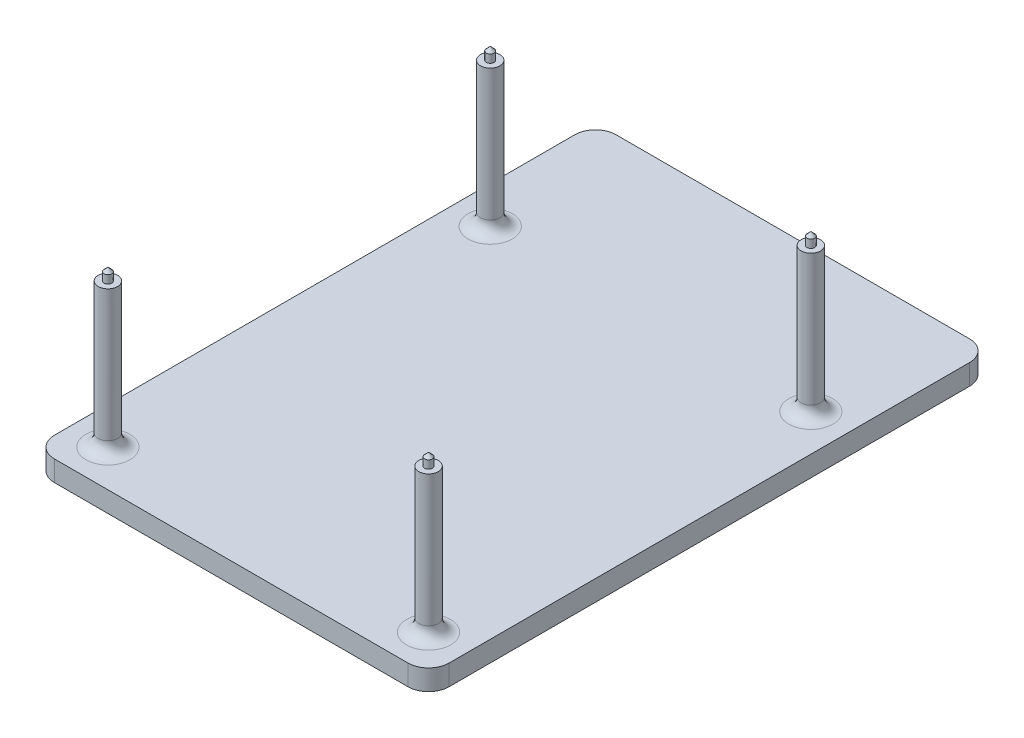
ISO-10303-21;
HEADER;
FILE_DESCRIPTION(('STEP AP214'),'2;1');
FILE_NAME('part.step','',(''),(''),'','','');
FILE_SCHEMA(('AUTOMOTIVE_DESIGN { 1 0 10303 214 1 1 1 1 }'));
ENDSEC;
DATA;
#1=APPLICATION_CONTEXT('core data for automotive mechanical design processes');
#2=APPLICATION_PROTOCOL_DEFINITION('international standard','automotive_design',2000,#1);
#3=PRODUCT_CONTEXT('',#1,'mechanical');
#4=PRODUCT('Part','Part','',(#3));
#5=PRODUCT_RELATED_PRODUCT_CATEGORY('part','',(#4));
#6=PRODUCT_DEFINITION_FORMATION('','',#4);
#7=PRODUCT_DEFINITION_CONTEXT('part definition',#1,'design');
#8=PRODUCT_DEFINITION('design','',#6,#7);
#9=PRODUCT_DEFINITION_SHAPE('','',#8);
#10=(LENGTH_UNIT() NAMED_UNIT(*) SI_UNIT(.MILLI.,.METRE.));
#11=(NAMED_UNIT(*) PLANE_ANGLE_UNIT() SI_UNIT($,.RADIAN.));
#12=(NAMED_UNIT(*) SI_UNIT($,.STERADIAN.) SOLID_ANGLE_UNIT());
#13=UNCERTAINTY_MEASURE_WITH_UNIT(LENGTH_MEASURE(1.E-05),#10,'distance_accuracy_value','');
#14=(GEOMETRIC_REPRESENTATION_CONTEXT(3) GLOBAL_UNCERTAINTY_ASSIGNED_CONTEXT((#13)) GLOBAL_UNIT_ASSIGNED_CONTEXT((#10,
#11,#12)) REPRESENTATION_CONTEXT('',''));
#15=CARTESIAN_POINT('',(0.,0.,0.));
#16=DIRECTION('',(0.,0.,1.));
#17=DIRECTION('',(1.,0.,0.));
#18=AXIS2_PLACEMENT_3D('',#15,#16,#17);
#19=CARTESIAN_POINT('',(-6.35,6.35,-167.132));
#20=DIRECTION('',(1.,0.,0.));
#21=DIRECTION('',(0.,0.,-1.));
#22=AXIS2_PLACEMENT_3D('',#19,#20,#21);
#23=PLANE('',#22);
#24=DIRECTION('',(0.,0.,1.));
#25=VECTOR('',#24,1.);
#26=CARTESIAN_POINT('',(-6.35,0.,-167.132));
#27=LINE('',#26,#25);
#28=CARTESIAN_POINT('',(-6.35,0.,-160.782));
#29=VERTEX_POINT('',#28);
#30=CARTESIAN_POINT('',(-6.35,0.,0.));
#31=VERTEX_POINT('',#30);
#32=EDGE_CURVE('E279',#29,#31,#27,.T.);
#33=ORIENTED_EDGE('',*,*,#32,.T.);
#34=DIRECTION('',(0.,-1.,0.));
#35=VECTOR('',#34,1.);
#36=CARTESIAN_POINT('',(-6.35,6.35,0.));
#37=LINE('',#36,#35);
#38=CARTESIAN_POINT('',(-6.35,6.35,0.));
#39=VERTEX_POINT('',#38);
#40=EDGE_CURVE('E222',#31,#39,#37,.F.);
#41=ORIENTED_EDGE('',*,*,#40,.T.);
#42=DIRECTION('',(0.,0.,1.));
#43=VECTOR('',#42,1.);
#44=CARTESIAN_POINT('',(-6.35,6.35,-167.132));
#45=LINE('',#44,#43);
#46=CARTESIAN_POINT('',(-6.35,6.35,-160.782));
#47=VERTEX_POINT('',#46);
#48=EDGE_CURVE('E270',#47,#39,#45,.T.);
#49=ORIENTED_EDGE('',*,*,#48,.F.);
#50=DIRECTION('',(0.,-1.,0.));
#51=VECTOR('',#50,1.);
#52=CARTESIAN_POINT('',(-6.35,6.35,-160.782));
#53=LINE('',#52,#51);
#54=EDGE_CURVE('E225',#47,#29,#53,.T.);
#55=ORIENTED_EDGE('',*,*,#54,.T.);
#56=EDGE_LOOP('',(#33,#41,#49,#55));
#57=FACE_BOUND('',#56,.T.);
#58=ADVANCED_FACE('F41',(#57),#23,.F.);
#59=CARTESIAN_POINT('',(115.57,6.35,6.35000000000002));
#60=DIRECTION('',(0.,0.,-1.));
#61=DIRECTION('',(-1.,0.,0.));
#62=AXIS2_PLACEMENT_3D('',#59,#60,#61);
#63=PLANE('',#62);
#64=DIRECTION('',(1.,0.,0.));
#65=VECTOR('',#64,1.);
#66=CARTESIAN_POINT('',(115.57,0.,6.35000000000002));
#67=LINE('',#66,#65);
#68=CARTESIAN_POINT('',(0.,0.,6.35000000000002));
#69=VERTEX_POINT('',#68);
#70=CARTESIAN_POINT('',(109.22,0.,6.35000000000002));
#71=VERTEX_POINT('',#70);
#72=EDGE_CURVE('E275',#69,#71,#67,.T.);
#73=ORIENTED_EDGE('',*,*,#72,.T.);
#74=DIRECTION('',(0.,-1.,0.));
#75=VECTOR('',#74,1.);
#76=CARTESIAN_POINT('',(109.22,6.35,6.35000000000002));
#77=LINE('',#76,#75);
#78=CARTESIAN_POINT('',(109.22,6.35,6.35000000000002));
#79=VERTEX_POINT('',#78);
#80=EDGE_CURVE('E240',#71,#79,#77,.F.);
#81=ORIENTED_EDGE('',*,*,#80,.T.);
#82=DIRECTION('',(1.,0.,0.));
#83=VECTOR('',#82,1.);
#84=CARTESIAN_POINT('',(115.57,6.35,6.35000000000002));
#85=LINE('',#84,#83);
#86=CARTESIAN_POINT('',(0.,6.35,6.35000000000002));
#87=VERTEX_POINT('',#86);
#88=EDGE_CURVE('E288',#87,#79,#85,.T.);
#89=ORIENTED_EDGE('',*,*,#88,.F.);
#90=DIRECTION('',(0.,-1.,0.));
#91=VECTOR('',#90,1.);
#92=CARTESIAN_POINT('',(0.,6.35,6.35000000000002));
#93=LINE('',#92,#91);
#94=EDGE_CURVE('E243',#87,#69,#93,.T.);
#95=ORIENTED_EDGE('',*,*,#94,.T.);
#96=EDGE_LOOP('',(#73,#81,#89,#95));
#97=FACE_BOUND('',#96,.T.);
#98=ADVANCED_FACE('F138',(#97),#63,.F.);
#99=CARTESIAN_POINT('',(115.57,6.35,-167.132));
#100=DIRECTION('',(-1.,0.,0.));
#101=DIRECTION('',(0.,0.,1.));
#102=AXIS2_PLACEMENT_3D('',#99,#100,#101);
#103=PLANE('',#102);
#104=DIRECTION('',(0.,0.,-1.));
#105=VECTOR('',#104,1.);
#106=CARTESIAN_POINT('',(115.57,6.35,-167.132));
#107=LINE('',#106,#105);
#108=CARTESIAN_POINT('',(115.57,6.35,0.));
#109=VERTEX_POINT('',#108);
#110=CARTESIAN_POINT('',(115.57,6.35,-160.782));
#111=VERTEX_POINT('',#110);
#112=EDGE_CURVE('E285',#109,#111,#107,.T.);
#113=ORIENTED_EDGE('',*,*,#112,.F.);
#114=DIRECTION('',(0.,-1.,0.));
#115=VECTOR('',#114,1.);
#116=CARTESIAN_POINT('',(115.57,6.35,0.));
#117=LINE('',#116,#115);
#118=CARTESIAN_POINT('',(115.57,0.,0.));
#119=VERTEX_POINT('',#118);
#120=EDGE_CURVE('E259',#109,#119,#117,.T.);
#121=ORIENTED_EDGE('',*,*,#120,.T.);
#122=DIRECTION('',(0.,0.,-1.));
#123=VECTOR('',#122,1.);
#124=CARTESIAN_POINT('',(115.57,0.,-167.132));
#125=LINE('',#124,#123);
#126=CARTESIAN_POINT('',(115.57,0.,-160.782));
#127=VERTEX_POINT('',#126);
#128=EDGE_CURVE('E271',#119,#127,#125,.T.);
#129=ORIENTED_EDGE('',*,*,#128,.T.);
#130=DIRECTION('',(0.,-1.,0.));
#131=VECTOR('',#130,1.);
#132=CARTESIAN_POINT('',(115.57,6.35,-160.782));
#133=LINE('',#132,#131);
#134=EDGE_CURVE('E263',#127,#111,#133,.F.);
#135=ORIENTED_EDGE('',*,*,#134,.T.);
#136=EDGE_LOOP('',(#113,#121,#129,#135));
#137=FACE_BOUND('',#136,.T.);
#138=ADVANCED_FACE('F144',(#137),#103,.F.);
#139=CARTESIAN_POINT('',(115.57,6.35,-167.132));
#140=DIRECTION('',(0.,0.,1.));
#141=DIRECTION('',(1.,0.,0.));
#142=AXIS2_PLACEMENT_3D('',#139,#140,#141);
#143=PLANE('',#142);
#144=DIRECTION('',(-1.,0.,0.));
#145=VECTOR('',#144,1.);
#146=CARTESIAN_POINT('',(115.57,6.35,-167.132));
#147=LINE('',#146,#145);
#148=CARTESIAN_POINT('',(109.22,6.35,-167.132));
#149=VERTEX_POINT('',#148);
#150=CARTESIAN_POINT('',(0.,6.35,-167.132));
#151=VERTEX_POINT('',#150);
#152=EDGE_CURVE('E266',#149,#151,#147,.T.);
#153=ORIENTED_EDGE('',*,*,#152,.F.);
#154=DIRECTION('',(0.,-1.,0.));
#155=VECTOR('',#154,1.);
#156=CARTESIAN_POINT('',(109.22,6.35,-167.132));
#157=LINE('',#156,#155);
#158=CARTESIAN_POINT('',(109.22,0.,-167.132));
#159=VERTEX_POINT('',#158);
#160=EDGE_CURVE('E216',#149,#159,#157,.T.);
#161=ORIENTED_EDGE('',*,*,#160,.T.);
#162=DIRECTION('',(-1.,0.,0.));
#163=VECTOR('',#162,1.);
#164=CARTESIAN_POINT('',(115.57,0.,-167.132));
#165=LINE('',#164,#163);
#166=CARTESIAN_POINT('',(0.,0.,-167.132));
#167=VERTEX_POINT('',#166);
#168=EDGE_CURVE('E267',#159,#167,#165,.T.);
#169=ORIENTED_EDGE('',*,*,#168,.T.);
#170=DIRECTION('',(0.,-1.,0.));
#171=VECTOR('',#170,1.);
#172=CARTESIAN_POINT('',(0.,6.35,-167.132));
#173=LINE('',#172,#171);
#174=EDGE_CURVE('E59',#167,#151,#173,.F.);
#175=ORIENTED_EDGE('',*,*,#174,.T.);
#176=EDGE_LOOP('',(#153,#161,#169,#175));
#177=FACE_BOUND('',#176,.T.);
#178=ADVANCED_FACE('F397',(#177),#143,.F.);
#179=CARTESIAN_POINT('',(0.,6.35,0.));
#180=DIRECTION('',(0.,-1.,0.));
#181=DIRECTION('',(0.,0.,-1.));
#182=AXIS2_PLACEMENT_3D('',#179,#180,#181);
#183=PLANE('',#182);
#184=CARTESIAN_POINT('',(104.14,6.35,-5.08));
#185=DIRECTION('',(0.,-1.,0.));
#186=DIRECTION('',(0.,0.,-1.));
#187=AXIS2_PLACEMENT_3D('',#184,#185,#186);
#188=CIRCLE('',#187,6.81000000000001);
#189=CARTESIAN_POINT('',(104.14,6.35,-11.89));
#190=VERTEX_POINT('',#189);
#191=EDGE_CURVE('E196',#190,#190,#188,.T.);
#192=ORIENTED_EDGE('',*,*,#191,.T.);
#193=EDGE_LOOP('',(#192));
#194=FACE_BOUND('',#193,.T.);
#195=CARTESIAN_POINT('',(104.14,6.35,-123.19));
#196=DIRECTION('',(0.,-1.,0.));
#197=DIRECTION('',(0.,0.,-1.));
#198=AXIS2_PLACEMENT_3D('',#195,#196,#197);
#199=CIRCLE('',#198,6.81000000000001);
#200=CARTESIAN_POINT('',(104.14,6.35,-130.));
#201=VERTEX_POINT('',#200);
#202=EDGE_CURVE('E202',#201,#201,#199,.T.);
#203=ORIENTED_EDGE('',*,*,#202,.T.);
#204=EDGE_LOOP('',(#203));
#205=FACE_BOUND('',#204,.T.);
#206=CARTESIAN_POINT('',(5.07999999999999,6.35,-123.19));
#207=DIRECTION('',(0.,-1.,0.));
#208=DIRECTION('',(0.,0.,-1.));
#209=AXIS2_PLACEMENT_3D('',#206,#207,#208);
#210=CIRCLE('',#209,6.81);
#211=CARTESIAN_POINT('',(5.07999999999999,6.35,-130.));
#212=VERTEX_POINT('',#211);
#213=EDGE_CURVE('E185',#212,#212,#210,.T.);
#214=ORIENTED_EDGE('',*,*,#213,.T.);
#215=EDGE_LOOP('',(#214));
#216=FACE_BOUND('',#215,.T.);
#217=CARTESIAN_POINT('',(5.08,6.35,-5.08));
#218=DIRECTION('',(0.,-1.,0.));
#219=DIRECTION('',(0.,0.,-1.));
#220=AXIS2_PLACEMENT_3D('',#217,#218,#219);
#221=CIRCLE('',#220,6.81);
#222=CARTESIAN_POINT('',(5.08,6.35,-11.89));
#223=VERTEX_POINT('',#222);
#224=EDGE_CURVE('E208',#223,#223,#221,.T.);
#225=ORIENTED_EDGE('',*,*,#224,.T.);
#226=EDGE_LOOP('',(#225));
#227=FACE_BOUND('',#226,.T.);
#228=ORIENTED_EDGE('',*,*,#88,.T.);
#229=CARTESIAN_POINT('',(109.22,6.35,0.));
#230=DIRECTION('',(0.,-1.,0.));
#231=DIRECTION('',(0.,0.,-1.));
#232=AXIS2_PLACEMENT_3D('',#229,#230,#231);
#233=CIRCLE('',#232,6.35);
#234=EDGE_CURVE('E229',#79,#109,#233,.F.);
#235=ORIENTED_EDGE('',*,*,#234,.T.);
#236=ORIENTED_EDGE('',*,*,#112,.T.);
#237=CARTESIAN_POINT('',(109.22,6.35,-160.782));
#238=DIRECTION('',(0.,-1.,0.));
#239=DIRECTION('',(0.,0.,-1.));
#240=AXIS2_PLACEMENT_3D('',#237,#238,#239);
#241=CIRCLE('',#240,6.35);
#242=EDGE_CURVE('E66',#111,#149,#241,.F.);
#243=ORIENTED_EDGE('',*,*,#242,.T.);
#244=ORIENTED_EDGE('',*,*,#152,.T.);
#245=CARTESIAN_POINT('',(0.,6.35,-160.782));
#246=DIRECTION('',(0.,-1.,0.));
#247=DIRECTION('',(0.,0.,-1.));
#248=AXIS2_PLACEMENT_3D('',#245,#246,#247);
#249=CIRCLE('',#248,6.35);
#250=EDGE_CURVE('E237',#151,#47,#249,.F.);
#251=ORIENTED_EDGE('',*,*,#250,.T.);
#252=ORIENTED_EDGE('',*,*,#48,.T.);
#253=CARTESIAN_POINT('',(0.,6.35,0.));
#254=DIRECTION('',(0.,-1.,0.));
#255=DIRECTION('',(0.,0.,-1.));
#256=AXIS2_PLACEMENT_3D('',#253,#254,#255);
#257=CIRCLE('',#256,6.35);
#258=EDGE_CURVE('E232',#39,#87,#257,.F.);
#259=ORIENTED_EDGE('',*,*,#258,.T.);
#260=EDGE_LOOP('',(#228,#235,#236,#243,#244,#251,#252,#259));
#261=FACE_BOUND('',#260,.T.);
#262=ADVANCED_FACE('F394',(#194,#205,#216,#227,#261),#183,.F.);
#263=CARTESIAN_POINT('',(0.,0.,0.));
#264=DIRECTION('',(0.,-1.,0.));
#265=DIRECTION('',(0.,0.,-1.));
#266=AXIS2_PLACEMENT_3D('',#263,#264,#265);
#267=PLANE('',#266);
#268=ORIENTED_EDGE('',*,*,#128,.F.);
#269=CARTESIAN_POINT('',(109.22,0.,0.));
#270=DIRECTION('',(0.,-1.,0.));
#271=DIRECTION('',(0.,0.,-1.));
#272=AXIS2_PLACEMENT_3D('',#269,#270,#271);
#273=CIRCLE('',#272,6.35);
#274=EDGE_CURVE('E247',#119,#71,#273,.T.);
#275=ORIENTED_EDGE('',*,*,#274,.T.);
#276=ORIENTED_EDGE('',*,*,#72,.F.);
#277=CARTESIAN_POINT('',(0.,0.,0.));
#278=DIRECTION('',(0.,-1.,0.));
#279=DIRECTION('',(0.,0.,-1.));
#280=AXIS2_PLACEMENT_3D('',#277,#278,#279);
#281=CIRCLE('',#280,6.35);
#282=EDGE_CURVE('E250',#69,#31,#281,.T.);
#283=ORIENTED_EDGE('',*,*,#282,.T.);
#284=ORIENTED_EDGE('',*,*,#32,.F.);
#285=CARTESIAN_POINT('',(0.,0.,-160.782));
#286=DIRECTION('',(0.,-1.,0.));
#287=DIRECTION('',(0.,0.,-1.));
#288=AXIS2_PLACEMENT_3D('',#285,#286,#287);
#289=CIRCLE('',#288,6.35);
#290=EDGE_CURVE('E256',#29,#167,#289,.T.);
#291=ORIENTED_EDGE('',*,*,#290,.T.);
#292=ORIENTED_EDGE('',*,*,#168,.F.);
#293=CARTESIAN_POINT('',(109.22,0.,-160.782));
#294=DIRECTION('',(0.,-1.,0.));
#295=DIRECTION('',(0.,0.,-1.));
#296=AXIS2_PLACEMENT_3D('',#293,#294,#295);
#297=CIRCLE('',#296,6.35);
#298=EDGE_CURVE('E253',#159,#127,#297,.T.);
#299=ORIENTED_EDGE('',*,*,#298,.T.);
#300=EDGE_LOOP('',(#268,#275,#276,#283,#284,#291,#292,#299));
#301=FACE_BOUND('',#300,.T.);
#302=ADVANCED_FACE('F392',(#301),#267,.T.);
#303=CARTESIAN_POINT('',(104.14,50.8,-5.08));
#304=DIRECTION('',(0.,-1.,0.));
#305=DIRECTION('',(0.,0.,-1.));
#306=AXIS2_PLACEMENT_3D('',#303,#304,#305);
#307=CYLINDRICAL_SURFACE('',#306,3.00000000000001);
#308=CARTESIAN_POINT('',(104.14,10.16,-5.08));
#309=DIRECTION('',(0.,-1.,0.));
#310=DIRECTION('',(0.,0.,-1.));
#311=AXIS2_PLACEMENT_3D('',#308,#309,#310);
#312=CIRCLE('',#311,3.00000000000001);
#313=CARTESIAN_POINT('',(104.14,10.16,-8.08000000000001));
#314=VERTEX_POINT('',#313);
#315=EDGE_CURVE('E212',#314,#314,#312,.F.);
#316=ORIENTED_EDGE('',*,*,#315,.T.);
#317=EDGE_LOOP('',(#316));
#318=FACE_BOUND('',#317,.T.);
#319=CARTESIAN_POINT('',(104.14,50.8,-5.08));
#320=DIRECTION('',(0.,1.,0.));
#321=DIRECTION('',(0.,0.,1.));
#322=AXIS2_PLACEMENT_3D('',#319,#320,#321);
#323=CIRCLE('',#322,3.00000000000001);
#324=CARTESIAN_POINT('',(104.14,50.8,-2.07999999999999));
#325=VERTEX_POINT('',#324);
#326=EDGE_CURVE('E282',#325,#325,#323,.T.);
#327=ORIENTED_EDGE('',*,*,#326,.F.);
#328=EDGE_LOOP('',(#327));
#329=FACE_BOUND('',#328,.T.);
#330=ADVANCED_FACE('F389',(#318,#329),#307,.T.);
#331=CARTESIAN_POINT('',(104.14,50.8,-5.08));
#332=DIRECTION('',(0.,1.,0.));
#333=DIRECTION('',(0.,0.,1.));
#334=AXIS2_PLACEMENT_3D('',#331,#332,#333);
#335=PLANE('',#334);
#336=CARTESIAN_POINT('',(104.14,50.8,-5.08000000000001));
#337=DIRECTION('',(0.,-1.,0.));
#338=DIRECTION('',(0.,0.,1.));
#339=AXIS2_PLACEMENT_3D('',#336,#337,#338);
#340=CIRCLE('',#339,1.199999886);
#341=CARTESIAN_POINT('',(104.14,50.8,-3.88000011400001));
#342=VERTEX_POINT('',#341);
#343=EDGE_CURVE('E329',#342,#342,#340,.T.);
#344=ORIENTED_EDGE('',*,*,#343,.T.);
#345=EDGE_LOOP('',(#344));
#346=FACE_BOUND('',#345,.T.);
#347=ORIENTED_EDGE('',*,*,#326,.T.);
#348=EDGE_LOOP('',(#347));
#349=FACE_BOUND('',#348,.T.);
#350=ADVANCED_FACE('F339',(#346,#349),#335,.T.);
#351=CARTESIAN_POINT('',(104.14,50.8,-123.19));
#352=DIRECTION('',(0.,-1.,0.));
#353=DIRECTION('',(0.,0.,-1.));
#354=AXIS2_PLACEMENT_3D('',#351,#352,#353);
#355=CYLINDRICAL_SURFACE('',#354,3.00000000000001);
#356=CARTESIAN_POINT('',(104.14,10.16,-123.19));
#357=DIRECTION('',(0.,-1.,0.));
#358=DIRECTION('',(0.,0.,-1.));
#359=AXIS2_PLACEMENT_3D('',#356,#357,#358);
#360=CIRCLE('',#359,3.00000000000001);
#361=CARTESIAN_POINT('',(104.14,10.16,-126.19));
#362=VERTEX_POINT('',#361);
#363=EDGE_CURVE('E191',#362,#362,#360,.F.);
#364=ORIENTED_EDGE('',*,*,#363,.T.);
#365=EDGE_LOOP('',(#364));
#366=FACE_BOUND('',#365,.T.);
#367=CARTESIAN_POINT('',(104.14,50.8,-123.19));
#368=DIRECTION('',(0.,1.,0.));
#369=DIRECTION('',(0.,0.,1.));
#370=AXIS2_PLACEMENT_3D('',#367,#368,#369);
#371=CIRCLE('',#370,3.00000000000001);
#372=CARTESIAN_POINT('',(104.14,50.8,-120.19));
#373=VERTEX_POINT('',#372);
#374=EDGE_CURVE('E298',#373,#373,#371,.T.);
#375=ORIENTED_EDGE('',*,*,#374,.F.);
#376=EDGE_LOOP('',(#375));
#377=FACE_BOUND('',#376,.T.);
#378=ADVANCED_FACE('F382',(#366,#377),#355,.T.);
#379=CARTESIAN_POINT('',(104.14,50.8,-123.19));
#380=DIRECTION('',(0.,1.,0.));
#381=DIRECTION('',(0.,0.,1.));
#382=AXIS2_PLACEMENT_3D('',#379,#380,#381);
#383=PLANE('',#382);
#384=CARTESIAN_POINT('',(104.14,50.8,-123.19));
#385=DIRECTION('',(0.,1.,0.));
#386=DIRECTION('',(0.,0.,-1.));
#387=AXIS2_PLACEMENT_3D('',#384,#385,#386);
#388=CIRCLE('',#387,1.199999886);
#389=CARTESIAN_POINT('',(104.14,50.8,-124.389999886));
#390=VERTEX_POINT('',#389);
#391=EDGE_CURVE('E11',#390,#390,#388,.T.);
#392=ORIENTED_EDGE('',*,*,#391,.F.);
#393=EDGE_LOOP('',(#392));
#394=FACE_BOUND('',#393,.T.);
#395=ORIENTED_EDGE('',*,*,#374,.T.);
#396=EDGE_LOOP('',(#395));
#397=FACE_BOUND('',#396,.T.);
#398=ADVANCED_FACE('F379',(#394,#397),#383,.T.);
#399=CARTESIAN_POINT('',(5.07999999999999,50.8,-123.19));
#400=DIRECTION('',(0.,-1.,0.));
#401=DIRECTION('',(0.,0.,-1.));
#402=AXIS2_PLACEMENT_3D('',#399,#400,#401);
#403=CYLINDRICAL_SURFACE('',#402,3.);
#404=CARTESIAN_POINT('',(5.07999999999999,10.16,-123.19));
#405=DIRECTION('',(0.,-1.,0.));
#406=DIRECTION('',(0.,0.,-1.));
#407=AXIS2_PLACEMENT_3D('',#404,#405,#406);
#408=CIRCLE('',#407,3.);
#409=CARTESIAN_POINT('',(5.07999999999999,10.16,-126.19));
#410=VERTEX_POINT('',#409);
#411=EDGE_CURVE('E188',#410,#410,#408,.F.);
#412=ORIENTED_EDGE('',*,*,#411,.T.);
#413=EDGE_LOOP('',(#412));
#414=FACE_BOUND('',#413,.T.);
#415=CARTESIAN_POINT('',(5.07999999999999,50.8,-123.19));
#416=DIRECTION('',(0.,1.,0.));
#417=DIRECTION('',(0.,0.,1.));
#418=AXIS2_PLACEMENT_3D('',#415,#416,#417);
#419=CIRCLE('',#418,3.);
#420=CARTESIAN_POINT('',(5.07999999999999,50.8,-120.19));
#421=VERTEX_POINT('',#420);
#422=EDGE_CURVE('E302',#421,#421,#419,.T.);
#423=ORIENTED_EDGE('',*,*,#422,.F.);
#424=EDGE_LOOP('',(#423));
#425=FACE_BOUND('',#424,.T.);
#426=ADVANCED_FACE('F375',(#414,#425),#403,.T.);
#427=CARTESIAN_POINT('',(5.07999999999999,50.8,-123.19));
#428=DIRECTION('',(0.,1.,0.));
#429=DIRECTION('',(0.,0.,1.));
#430=AXIS2_PLACEMENT_3D('',#427,#428,#429);
#431=PLANE('',#430);
#432=CARTESIAN_POINT('',(5.08,50.8,-123.19));
#433=DIRECTION('',(0.,-1.,0.));
#434=DIRECTION('',(0.,0.,-1.));
#435=AXIS2_PLACEMENT_3D('',#432,#433,#434);
#436=CIRCLE('',#435,1.199999886);
#437=CARTESIAN_POINT('',(5.08,50.8,-124.389999886));
#438=VERTEX_POINT('',#437);
#439=EDGE_CURVE('E321',#438,#438,#436,.T.);
#440=ORIENTED_EDGE('',*,*,#439,.T.);
#441=EDGE_LOOP('',(#440));
#442=FACE_BOUND('',#441,.T.);
#443=ORIENTED_EDGE('',*,*,#422,.T.);
#444=EDGE_LOOP('',(#443));
#445=FACE_BOUND('',#444,.T.);
#446=ADVANCED_FACE('F371',(#442,#445),#431,.T.);
#447=CARTESIAN_POINT('',(5.08,50.8,-5.08));
#448=DIRECTION('',(0.,-1.,0.));
#449=DIRECTION('',(0.,0.,-1.));
#450=AXIS2_PLACEMENT_3D('',#447,#448,#449);
#451=CYLINDRICAL_SURFACE('',#450,3.);
#452=CARTESIAN_POINT('',(5.08,10.16,-5.08));
#453=DIRECTION('',(0.,-1.,0.));
#454=DIRECTION('',(0.,0.,-1.));
#455=AXIS2_PLACEMENT_3D('',#452,#453,#454);
#456=CIRCLE('',#455,3.);
#457=CARTESIAN_POINT('',(5.08,10.16,-8.08));
#458=VERTEX_POINT('',#457);
#459=EDGE_CURVE('E45',#458,#458,#456,.F.);
#460=ORIENTED_EDGE('',*,*,#459,.T.);
#461=EDGE_LOOP('',(#460));
#462=FACE_BOUND('',#461,.T.);
#463=CARTESIAN_POINT('',(5.08,50.8,-5.08));
#464=DIRECTION('',(0.,1.,0.));
#465=DIRECTION('',(0.,0.,1.));
#466=AXIS2_PLACEMENT_3D('',#463,#464,#465);
#467=CIRCLE('',#466,3.);
#468=CARTESIAN_POINT('',(5.08,50.8,-2.08));
#469=VERTEX_POINT('',#468);
#470=EDGE_CURVE('E306',#469,#469,#467,.T.);
#471=ORIENTED_EDGE('',*,*,#470,.F.);
#472=EDGE_LOOP('',(#471));
#473=FACE_BOUND('',#472,.T.);
#474=ADVANCED_FACE('F367',(#462,#473),#451,.T.);
#475=CARTESIAN_POINT('',(5.08,50.8,-5.08));
#476=DIRECTION('',(0.,1.,0.));
#477=DIRECTION('',(0.,0.,1.));
#478=AXIS2_PLACEMENT_3D('',#475,#476,#477);
#479=PLANE('',#478);
#480=CARTESIAN_POINT('',(5.08,50.8,-5.08));
#481=DIRECTION('',(0.,1.,0.));
#482=DIRECTION('',(0.,0.,1.));
#483=AXIS2_PLACEMENT_3D('',#480,#481,#482);
#484=CIRCLE('',#483,1.199999886);
#485=CARTESIAN_POINT('',(5.08,50.8,-3.880000114));
#486=VERTEX_POINT('',#485);
#487=EDGE_CURVE('E51',#486,#486,#484,.T.);
#488=ORIENTED_EDGE('',*,*,#487,.F.);
#489=EDGE_LOOP('',(#488));
#490=FACE_BOUND('',#489,.T.);
#491=ORIENTED_EDGE('',*,*,#470,.T.);
#492=EDGE_LOOP('',(#491));
#493=FACE_BOUND('',#492,.T.);
#494=ADVANCED_FACE('F154',(#490,#493),#479,.T.);
#495=CARTESIAN_POINT('',(109.22,6.35,0.));
#496=DIRECTION('',(0.,-1.,0.));
#497=DIRECTION('',(0.,0.,-1.));
#498=AXIS2_PLACEMENT_3D('',#495,#496,#497);
#499=CYLINDRICAL_SURFACE('',#498,6.35);
#500=ORIENTED_EDGE('',*,*,#234,.F.);
#501=ORIENTED_EDGE('',*,*,#80,.F.);
#502=ORIENTED_EDGE('',*,*,#274,.F.);
#503=ORIENTED_EDGE('',*,*,#120,.F.);
#504=EDGE_LOOP('',(#500,#501,#502,#503));
#505=FACE_BOUND('',#504,.T.);
#506=ADVANCED_FACE('F150',(#505),#499,.T.);
#507=CARTESIAN_POINT('',(0.,6.35,0.));
#508=DIRECTION('',(0.,-1.,0.));
#509=DIRECTION('',(0.,0.,-1.));
#510=AXIS2_PLACEMENT_3D('',#507,#508,#509);
#511=CYLINDRICAL_SURFACE('',#510,6.35);
#512=ORIENTED_EDGE('',*,*,#258,.F.);
#513=ORIENTED_EDGE('',*,*,#40,.F.);
#514=ORIENTED_EDGE('',*,*,#282,.F.);
#515=ORIENTED_EDGE('',*,*,#94,.F.);
#516=EDGE_LOOP('',(#512,#513,#514,#515));
#517=FACE_BOUND('',#516,.T.);
#518=ADVANCED_FACE('F153',(#517),#511,.T.);
#519=CARTESIAN_POINT('',(109.22,6.35,-160.782));
#520=DIRECTION('',(0.,-1.,0.));
#521=DIRECTION('',(0.,0.,-1.));
#522=AXIS2_PLACEMENT_3D('',#519,#520,#521);
#523=CYLINDRICAL_SURFACE('',#522,6.35);
#524=ORIENTED_EDGE('',*,*,#242,.F.);
#525=ORIENTED_EDGE('',*,*,#134,.F.);
#526=ORIENTED_EDGE('',*,*,#298,.F.);
#527=ORIENTED_EDGE('',*,*,#160,.F.);
#528=EDGE_LOOP('',(#524,#525,#526,#527));
#529=FACE_BOUND('',#528,.T.);
#530=ADVANCED_FACE('F158',(#529),#523,.T.);
#531=CARTESIAN_POINT('',(0.,6.35,-160.782));
#532=DIRECTION('',(0.,-1.,0.));
#533=DIRECTION('',(0.,0.,-1.));
#534=AXIS2_PLACEMENT_3D('',#531,#532,#533);
#535=CYLINDRICAL_SURFACE('',#534,6.35);
#536=ORIENTED_EDGE('',*,*,#250,.F.);
#537=ORIENTED_EDGE('',*,*,#174,.F.);
#538=ORIENTED_EDGE('',*,*,#290,.F.);
#539=ORIENTED_EDGE('',*,*,#54,.F.);
#540=EDGE_LOOP('',(#536,#537,#538,#539));
#541=FACE_BOUND('',#540,.T.);
#542=ADVANCED_FACE('F162',(#541),#535,.T.);
#543=CARTESIAN_POINT('',(104.14,10.16,-5.08));
#544=DIRECTION('',(0.,-1.,0.));
#545=DIRECTION('',(0.,0.,-1.));
#546=AXIS2_PLACEMENT_3D('',#543,#544,#545);
#547=TOROIDAL_SURFACE('',#546,6.81000000000001,3.81);
#548=ORIENTED_EDGE('',*,*,#191,.F.);
#549=EDGE_LOOP('',(#548));
#550=FACE_BOUND('',#549,.T.);
#551=ORIENTED_EDGE('',*,*,#315,.F.);
#552=EDGE_LOOP('',(#551));
#553=FACE_BOUND('',#552,.T.);
#554=ADVANCED_FACE('F166',(#550,#553),#547,.F.);
#555=CARTESIAN_POINT('',(104.14,10.16,-123.19));
#556=DIRECTION('',(0.,-1.,0.));
#557=DIRECTION('',(0.,0.,-1.));
#558=AXIS2_PLACEMENT_3D('',#555,#556,#557);
#559=TOROIDAL_SURFACE('',#558,6.81000000000001,3.81);
#560=ORIENTED_EDGE('',*,*,#202,.F.);
#561=EDGE_LOOP('',(#560));
#562=FACE_BOUND('',#561,.T.);
#563=ORIENTED_EDGE('',*,*,#363,.F.);
#564=EDGE_LOOP('',(#563));
#565=FACE_BOUND('',#564,.T.);
#566=ADVANCED_FACE('F170',(#562,#565),#559,.F.);
#567=CARTESIAN_POINT('',(5.07999999999999,10.16,-123.19));
#568=DIRECTION('',(0.,-1.,0.));
#569=DIRECTION('',(0.,0.,-1.));
#570=AXIS2_PLACEMENT_3D('',#567,#568,#569);
#571=TOROIDAL_SURFACE('',#570,6.81,3.81);
#572=ORIENTED_EDGE('',*,*,#213,.F.);
#573=EDGE_LOOP('',(#572));
#574=FACE_BOUND('',#573,.T.);
#575=ORIENTED_EDGE('',*,*,#411,.F.);
#576=EDGE_LOOP('',(#575));
#577=FACE_BOUND('',#576,.T.);
#578=ADVANCED_FACE('F173',(#574,#577),#571,.F.);
#579=CARTESIAN_POINT('',(5.08,10.16,-5.08));
#580=DIRECTION('',(0.,-1.,0.));
#581=DIRECTION('',(0.,0.,-1.));
#582=AXIS2_PLACEMENT_3D('',#579,#580,#581);
#583=TOROIDAL_SURFACE('',#582,6.81,3.81);
#584=ORIENTED_EDGE('',*,*,#224,.F.);
#585=EDGE_LOOP('',(#584));
#586=FACE_BOUND('',#585,.T.);
#587=ORIENTED_EDGE('',*,*,#459,.F.);
#588=EDGE_LOOP('',(#587));
#589=FACE_BOUND('',#588,.T.);
#590=ADVANCED_FACE('F43',(#586,#589),#583,.F.);
#591=CARTESIAN_POINT('',(5.08,54.499999886,-5.08));
#592=DIRECTION('',(0.,-1.,0.));
#593=DIRECTION('',(0.,0.,-1.));
#594=AXIS2_PLACEMENT_3D('',#591,#592,#593);
#595=CONICAL_SURFACE('',#594,0.,0.785398163397446);
#596=CARTESIAN_POINT('',(5.08,53.3,-5.08));
#597=DIRECTION('',(0.,1.,0.));
#598=DIRECTION('',(0.,0.,1.));
#599=AXIS2_PLACEMENT_3D('',#596,#597,#598);
#600=CIRCLE('',#599,1.199999886);
#601=CARTESIAN_POINT('',(5.08,53.3,-3.880000114));
#602=VERTEX_POINT('',#601);
#603=EDGE_CURVE('E310',#602,#602,#600,.T.);
#604=ORIENTED_EDGE('',*,*,#603,.T.);
#605=EDGE_LOOP('',(#604));
#606=FACE_BOUND('',#605,.T.);
#607=CARTESIAN_POINT('',(5.08,54.499999886,-5.08));
#608=VERTEX_POINT('',#607);
#609=VERTEX_LOOP('',#608);
#610=FACE_BOUND('',#609,.T.);
#611=ADVANCED_FACE('F180',(#606,#610),#595,.T.);
#612=CARTESIAN_POINT('',(5.08,50.8,-5.08));
#613=DIRECTION('',(0.,1.,0.));
#614=DIRECTION('',(0.,0.,1.));
#615=AXIS2_PLACEMENT_3D('',#612,#613,#614);
#616=CYLINDRICAL_SURFACE('',#615,1.199999886);
#617=ORIENTED_EDGE('',*,*,#487,.T.);
#618=EDGE_LOOP('',(#617));
#619=FACE_BOUND('',#618,.T.);
#620=ORIENTED_EDGE('',*,*,#603,.F.);
#621=EDGE_LOOP('',(#620));
#622=FACE_BOUND('',#621,.T.);
#623=ADVANCED_FACE('F357',(#619,#622),#616,.T.);
#624=CARTESIAN_POINT('',(5.08,54.499999886,-123.19));
#625=DIRECTION('',(0.,-1.,0.));
#626=DIRECTION('',(0.,0.,1.));
#627=AXIS2_PLACEMENT_3D('',#624,#625,#626);
#628=CONICAL_SURFACE('',#627,0.,0.785398163397446);
#629=CARTESIAN_POINT('',(5.08,53.3,-123.19));
#630=DIRECTION('',(0.,-1.,0.));
#631=DIRECTION('',(0.,0.,-1.));
#632=AXIS2_PLACEMENT_3D('',#629,#630,#631);
#633=CIRCLE('',#632,1.199999886);
#634=CARTESIAN_POINT('',(5.08,53.3,-124.389999886));
#635=VERTEX_POINT('',#634);
#636=EDGE_CURVE('E314',#635,#635,#633,.T.);
#637=ORIENTED_EDGE('',*,*,#636,.F.);
#638=EDGE_LOOP('',(#637));
#639=FACE_BOUND('',#638,.T.);
#640=CARTESIAN_POINT('',(5.08,54.499999886,-123.19));
#641=VERTEX_POINT('',#640);
#642=VERTEX_LOOP('',#641);
#643=FACE_BOUND('',#642,.T.);
#644=ADVANCED_FACE('F351',(#639,#643),#628,.T.);
#645=CARTESIAN_POINT('',(5.08,50.8,-123.19));
#646=DIRECTION('',(0.,1.,0.));
#647=DIRECTION('',(0.,0.,-1.));
#648=AXIS2_PLACEMENT_3D('',#645,#646,#647);
#649=CYLINDRICAL_SURFACE('',#648,1.199999886);
#650=ORIENTED_EDGE('',*,*,#439,.F.);
#651=EDGE_LOOP('',(#650));
#652=FACE_BOUND('',#651,.T.);
#653=ORIENTED_EDGE('',*,*,#636,.T.);
#654=EDGE_LOOP('',(#653));
#655=FACE_BOUND('',#654,.T.);
#656=ADVANCED_FACE('F346',(#652,#655),#649,.T.);
#657=CARTESIAN_POINT('',(104.14,54.499999886,-5.08000000000001));
#658=DIRECTION('',(0.,-1.,0.));
#659=DIRECTION('',(0.,0.,-1.));
#660=AXIS2_PLACEMENT_3D('',#657,#658,#659);
#661=CONICAL_SURFACE('',#660,0.,0.785398163397446);
#662=CARTESIAN_POINT('',(104.14,53.3,-5.08000000000001));
#663=DIRECTION('',(0.,-1.,0.));
#664=DIRECTION('',(0.,0.,1.));
#665=AXIS2_PLACEMENT_3D('',#662,#663,#664);
#666=CIRCLE('',#665,1.199999886);
#667=CARTESIAN_POINT('',(104.14,53.3,-3.88000011400002));
#668=VERTEX_POINT('',#667);
#669=EDGE_CURVE('E325',#668,#668,#666,.T.);
#670=ORIENTED_EDGE('',*,*,#669,.F.);
#671=EDGE_LOOP('',(#670));
#672=FACE_BOUND('',#671,.T.);
#673=CARTESIAN_POINT('',(104.14,54.499999886,-5.08000000000001));
#674=VERTEX_POINT('',#673);
#675=VERTEX_LOOP('',#674);
#676=FACE_BOUND('',#675,.T.);
#677=ADVANCED_FACE('F133',(#672,#676),#661,.T.);
#678=CARTESIAN_POINT('',(104.14,50.8,-5.08000000000001));
#679=DIRECTION('',(0.,1.,0.));
#680=DIRECTION('',(0.,0.,1.));
#681=AXIS2_PLACEMENT_3D('',#678,#679,#680);
#682=CYLINDRICAL_SURFACE('',#681,1.199999886);
#683=ORIENTED_EDGE('',*,*,#343,.F.);
#684=EDGE_LOOP('',(#683));
#685=FACE_BOUND('',#684,.T.);
#686=ORIENTED_EDGE('',*,*,#669,.T.);
#687=EDGE_LOOP('',(#686));
#688=FACE_BOUND('',#687,.T.);
#689=ADVANCED_FACE('F124',(#685,#688),#682,.T.);
#690=CARTESIAN_POINT('',(104.14,54.499999886,-123.19));
#691=DIRECTION('',(0.,-1.,0.));
#692=DIRECTION('',(0.,0.,1.));
#693=AXIS2_PLACEMENT_3D('',#690,#691,#692);
#694=CONICAL_SURFACE('',#693,0.,0.785398163397446);
#695=CARTESIAN_POINT('',(104.14,53.3,-123.19));
#696=DIRECTION('',(0.,1.,0.));
#697=DIRECTION('',(0.,0.,-1.));
#698=AXIS2_PLACEMENT_3D('',#695,#696,#697);
#699=CIRCLE('',#698,1.199999886);
#700=CARTESIAN_POINT('',(104.14,53.3,-124.389999886));
#701=VERTEX_POINT('',#700);
#702=EDGE_CURVE('E333',#701,#701,#699,.T.);
#703=ORIENTED_EDGE('',*,*,#702,.T.);
#704=EDGE_LOOP('',(#703));
#705=FACE_BOUND('',#704,.T.);
#706=CARTESIAN_POINT('',(104.14,54.499999886,-123.19));
#707=VERTEX_POINT('',#706);
#708=VERTEX_LOOP('',#707);
#709=FACE_BOUND('',#708,.T.);
#710=ADVANCED_FACE('F121',(#705,#709),#694,.T.);
#711=CARTESIAN_POINT('',(104.14,50.8,-123.19));
#712=DIRECTION('',(0.,1.,0.));
#713=DIRECTION('',(0.,0.,-1.));
#714=AXIS2_PLACEMENT_3D('',#711,#712,#713);
#715=CYLINDRICAL_SURFACE('',#714,1.199999886);
#716=ORIENTED_EDGE('',*,*,#391,.T.);
#717=EDGE_LOOP('',(#716));
#718=FACE_BOUND('',#717,.T.);
#719=ORIENTED_EDGE('',*,*,#702,.F.);
#720=EDGE_LOOP('',(#719));
#721=FACE_BOUND('',#720,.T.);
#722=ADVANCED_FACE('F123',(#718,#721),#715,.T.);
#723=CLOSED_SHELL('',(#58,#98,#138,#178,#262,#302,#330,#350,#378,#398,#426,#446,#474,#494,#506,
#518,#530,#542,#554,#566,#578,#590,#611,#623,#644,#656,#677,#689,#710,#722));
#724=MANIFOLD_SOLID_BREP('B2',#723);
#725=ADVANCED_BREP_SHAPE_REPRESENTATION('',(#18,#724),#14);
#726=SHAPE_DEFINITION_REPRESENTATION(#9,#725);
ENDSEC;
END-ISO-10303-21;
